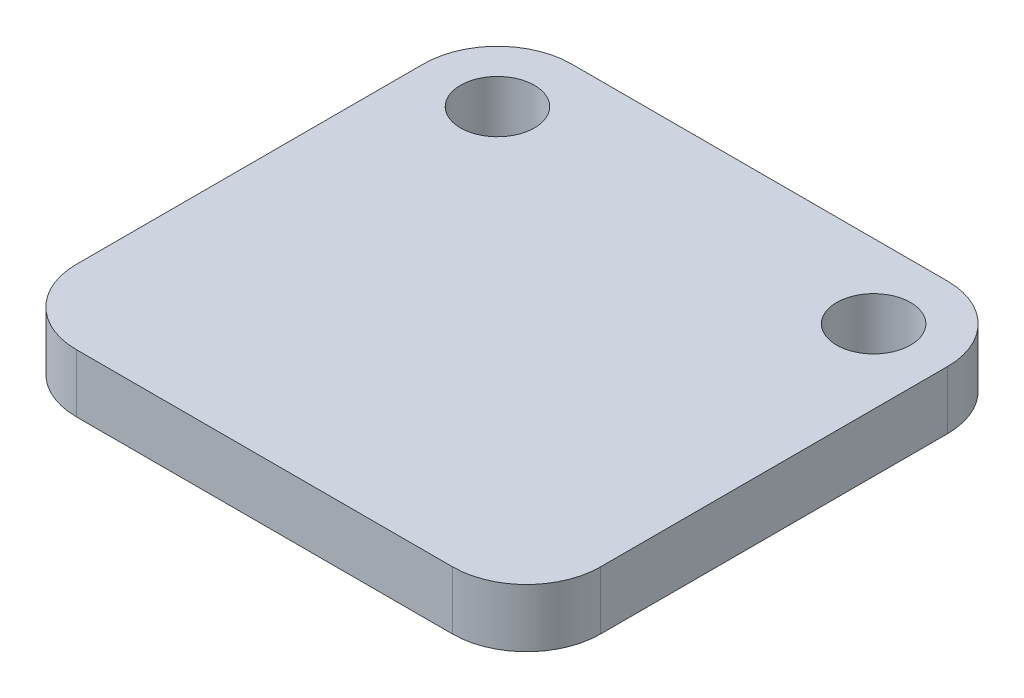
ISO-10303-21;
HEADER;
FILE_DESCRIPTION(('STEP AP214'),'2;1');
FILE_NAME('part.step','',(''),(''),'','','');
FILE_SCHEMA(('AUTOMOTIVE_DESIGN { 1 0 10303 214 1 1 1 1 }'));
ENDSEC;
DATA;
#1=APPLICATION_CONTEXT('core data for automotive mechanical design processes');
#2=APPLICATION_PROTOCOL_DEFINITION('international standard','automotive_design',2000,#1);
#3=PRODUCT_CONTEXT('',#1,'mechanical');
#4=PRODUCT('Part','Part','',(#3));
#5=PRODUCT_RELATED_PRODUCT_CATEGORY('part','',(#4));
#6=PRODUCT_DEFINITION_FORMATION('','',#4);
#7=PRODUCT_DEFINITION_CONTEXT('part definition',#1,'design');
#8=PRODUCT_DEFINITION('design','',#6,#7);
#9=PRODUCT_DEFINITION_SHAPE('','',#8);
#10=(LENGTH_UNIT() NAMED_UNIT(*) SI_UNIT(.MILLI.,.METRE.));
#11=(NAMED_UNIT(*) PLANE_ANGLE_UNIT() SI_UNIT($,.RADIAN.));
#12=(NAMED_UNIT(*) SI_UNIT($,.STERADIAN.) SOLID_ANGLE_UNIT());
#13=UNCERTAINTY_MEASURE_WITH_UNIT(LENGTH_MEASURE(1.E-05),#10,'distance_accuracy_value','');
#14=(GEOMETRIC_REPRESENTATION_CONTEXT(3) GLOBAL_UNCERTAINTY_ASSIGNED_CONTEXT((#13)) GLOBAL_UNIT_ASSIGNED_CONTEXT((#10,
#11,#12)) REPRESENTATION_CONTEXT('',''));
#15=CARTESIAN_POINT('',(0.,0.,0.));
#16=DIRECTION('',(0.,0.,1.));
#17=DIRECTION('',(1.,0.,0.));
#18=AXIS2_PLACEMENT_3D('',#15,#16,#17);
#19=CARTESIAN_POINT('',(0.,2.,0.));
#20=DIRECTION('',(1.,0.,0.));
#21=DIRECTION('',(0.,0.,-1.));
#22=AXIS2_PLACEMENT_3D('',#19,#20,#21);
#23=PLANE('',#22);
#24=DIRECTION('',(0.,0.,1.));
#25=VECTOR('',#24,1.);
#26=CARTESIAN_POINT('',(0.,0.,0.));
#27=LINE('',#26,#25);
#28=CARTESIAN_POINT('',(0.,0.,-14.46));
#29=VERTEX_POINT('',#28);
#30=CARTESIAN_POINT('',(0.,0.,-2.54));
#31=VERTEX_POINT('',#30);
#32=EDGE_CURVE('E142',#29,#31,#27,.T.);
#33=ORIENTED_EDGE('',*,*,#32,.T.);
#34=DIRECTION('',(0.,-1.,0.));
#35=VECTOR('',#34,1.);
#36=CARTESIAN_POINT('',(0.,2.,-2.54));
#37=LINE('',#36,#35);
#38=CARTESIAN_POINT('',(0.,2.,-2.54));
#39=VERTEX_POINT('',#38);
#40=EDGE_CURVE('E175',#31,#39,#37,.F.);
#41=ORIENTED_EDGE('',*,*,#40,.T.);
#42=DIRECTION('',(0.,0.,1.));
#43=VECTOR('',#42,1.);
#44=CARTESIAN_POINT('',(0.,2.,0.));
#45=LINE('',#44,#43);
#46=CARTESIAN_POINT('',(0.,2.,-14.46));
#47=VERTEX_POINT('',#46);
#48=EDGE_CURVE('E140',#47,#39,#45,.T.);
#49=ORIENTED_EDGE('',*,*,#48,.F.);
#50=DIRECTION('',(0.,-1.,0.));
#51=VECTOR('',#50,1.);
#52=CARTESIAN_POINT('',(0.,2.,-14.46));
#53=LINE('',#52,#51);
#54=EDGE_CURVE('E171',#47,#29,#53,.T.);
#55=ORIENTED_EDGE('',*,*,#54,.T.);
#56=EDGE_LOOP('',(#33,#41,#49,#55));
#57=FACE_BOUND('',#56,.T.);
#58=ADVANCED_FACE('F39',(#57),#23,.F.);
#59=CARTESIAN_POINT('',(0.,2.,0.));
#60=DIRECTION('',(0.,0.,-1.));
#61=DIRECTION('',(-1.,0.,0.));
#62=AXIS2_PLACEMENT_3D('',#59,#60,#61);
#63=PLANE('',#62);
#64=DIRECTION('',(1.,0.,0.));
#65=VECTOR('',#64,1.);
#66=CARTESIAN_POINT('',(0.,0.,0.));
#67=LINE('',#66,#65);
#68=CARTESIAN_POINT('',(2.54,0.,0.));
#69=VERTEX_POINT('',#68);
#70=CARTESIAN_POINT('',(15.46,0.,0.));
#71=VERTEX_POINT('',#70);
#72=EDGE_CURVE('E136',#69,#71,#67,.T.);
#73=ORIENTED_EDGE('',*,*,#72,.T.);
#74=DIRECTION('',(0.,-1.,0.));
#75=VECTOR('',#74,1.);
#76=CARTESIAN_POINT('',(15.46,2.,0.));
#77=LINE('',#76,#75);
#78=CARTESIAN_POINT('',(15.46,2.,0.));
#79=VERTEX_POINT('',#78);
#80=EDGE_CURVE('E111',#71,#79,#77,.F.);
#81=ORIENTED_EDGE('',*,*,#80,.T.);
#82=DIRECTION('',(1.,0.,0.));
#83=VECTOR('',#82,1.);
#84=CARTESIAN_POINT('',(0.,2.,0.));
#85=LINE('',#84,#83);
#86=CARTESIAN_POINT('',(2.54,2.,0.));
#87=VERTEX_POINT('',#86);
#88=EDGE_CURVE('E182',#87,#79,#85,.T.);
#89=ORIENTED_EDGE('',*,*,#88,.F.);
#90=DIRECTION('',(0.,-1.,0.));
#91=VECTOR('',#90,1.);
#92=CARTESIAN_POINT('',(2.54,2.,0.));
#93=LINE('',#92,#91);
#94=EDGE_CURVE('E117',#87,#69,#93,.T.);
#95=ORIENTED_EDGE('',*,*,#94,.T.);
#96=EDGE_LOOP('',(#73,#81,#89,#95));
#97=FACE_BOUND('',#96,.T.);
#98=ADVANCED_FACE('F228',(#97),#63,.F.);
#99=CARTESIAN_POINT('',(18.,2.,0.));
#100=DIRECTION('',(-1.,0.,0.));
#101=DIRECTION('',(0.,0.,1.));
#102=AXIS2_PLACEMENT_3D('',#99,#100,#101);
#103=PLANE('',#102);
#104=DIRECTION('',(0.,0.,-1.));
#105=VECTOR('',#104,1.);
#106=CARTESIAN_POINT('',(18.,2.,0.));
#107=LINE('',#106,#105);
#108=CARTESIAN_POINT('',(18.,2.,-2.54));
#109=VERTEX_POINT('',#108);
#110=CARTESIAN_POINT('',(18.,2.,-14.46));
#111=VERTEX_POINT('',#110);
#112=EDGE_CURVE('E126',#109,#111,#107,.T.);
#113=ORIENTED_EDGE('',*,*,#112,.F.);
#114=DIRECTION('',(0.,-1.,0.));
#115=VECTOR('',#114,1.);
#116=CARTESIAN_POINT('',(18.,2.,-2.54));
#117=LINE('',#116,#115);
#118=CARTESIAN_POINT('',(18.,0.,-2.54));
#119=VERTEX_POINT('',#118);
#120=EDGE_CURVE('E110',#109,#119,#117,.T.);
#121=ORIENTED_EDGE('',*,*,#120,.T.);
#122=DIRECTION('',(0.,0.,-1.));
#123=VECTOR('',#122,1.);
#124=CARTESIAN_POINT('',(18.,0.,0.));
#125=LINE('',#124,#123);
#126=CARTESIAN_POINT('',(18.,0.,-14.46));
#127=VERTEX_POINT('',#126);
#128=EDGE_CURVE('E124',#119,#127,#125,.T.);
#129=ORIENTED_EDGE('',*,*,#128,.T.);
#130=DIRECTION('',(0.,-1.,0.));
#131=VECTOR('',#130,1.);
#132=CARTESIAN_POINT('',(18.,2.,-14.46));
#133=LINE('',#132,#131);
#134=EDGE_CURVE('E129',#127,#111,#133,.F.);
#135=ORIENTED_EDGE('',*,*,#134,.T.);
#136=EDGE_LOOP('',(#113,#121,#129,#135));
#137=FACE_BOUND('',#136,.T.);
#138=ADVANCED_FACE('F123',(#137),#103,.F.);
#139=CARTESIAN_POINT('',(0.,2.,-17.));
#140=DIRECTION('',(0.,0.,1.));
#141=DIRECTION('',(1.,0.,0.));
#142=AXIS2_PLACEMENT_3D('',#139,#140,#141);
#143=PLANE('',#142);
#144=DIRECTION('',(-1.,0.,0.));
#145=VECTOR('',#144,1.);
#146=CARTESIAN_POINT('',(0.,2.,-17.));
#147=LINE('',#146,#145);
#148=CARTESIAN_POINT('',(15.46,2.,-17.));
#149=VERTEX_POINT('',#148);
#150=CARTESIAN_POINT('',(2.54,2.,-17.));
#151=VERTEX_POINT('',#150);
#152=EDGE_CURVE('E147',#149,#151,#147,.T.);
#153=ORIENTED_EDGE('',*,*,#152,.F.);
#154=DIRECTION('',(0.,-1.,0.));
#155=VECTOR('',#154,1.);
#156=CARTESIAN_POINT('',(15.46,2.,-17.));
#157=LINE('',#156,#155);
#158=CARTESIAN_POINT('',(15.46,0.,-17.));
#159=VERTEX_POINT('',#158);
#160=EDGE_CURVE('E11',#149,#159,#157,.T.);
#161=ORIENTED_EDGE('',*,*,#160,.T.);
#162=DIRECTION('',(-1.,0.,0.));
#163=VECTOR('',#162,1.);
#164=CARTESIAN_POINT('',(0.,0.,-17.));
#165=LINE('',#164,#163);
#166=CARTESIAN_POINT('',(2.54,0.,-17.));
#167=VERTEX_POINT('',#166);
#168=EDGE_CURVE('E135',#159,#167,#165,.T.);
#169=ORIENTED_EDGE('',*,*,#168,.T.);
#170=DIRECTION('',(0.,-1.,0.));
#171=VECTOR('',#170,1.);
#172=CARTESIAN_POINT('',(2.54,2.,-17.));
#173=LINE('',#172,#171);
#174=EDGE_CURVE('E48',#167,#151,#173,.F.);
#175=ORIENTED_EDGE('',*,*,#174,.T.);
#176=EDGE_LOOP('',(#153,#161,#169,#175));
#177=FACE_BOUND('',#176,.T.);
#178=ADVANCED_FACE('F222',(#177),#143,.F.);
#179=CARTESIAN_POINT('',(0.,2.,0.));
#180=DIRECTION('',(0.,-1.,0.));
#181=DIRECTION('',(0.,0.,-1.));
#182=AXIS2_PLACEMENT_3D('',#179,#180,#181);
#183=PLANE('',#182);
#184=CARTESIAN_POINT('',(2.54,2.,-14.46));
#185=DIRECTION('',(0.,1.,0.));
#186=DIRECTION('',(0.,0.,1.));
#187=AXIS2_PLACEMENT_3D('',#184,#185,#186);
#188=CIRCLE('',#187,1.27);
#189=CARTESIAN_POINT('',(2.54,2.,-13.19));
#190=VERTEX_POINT('',#189);
#191=EDGE_CURVE('E202',#190,#190,#188,.T.);
#192=ORIENTED_EDGE('',*,*,#191,.F.);
#193=EDGE_LOOP('',(#192));
#194=FACE_BOUND('',#193,.T.);
#195=CARTESIAN_POINT('',(15.46,2.,-14.46));
#196=DIRECTION('',(0.,1.,0.));
#197=DIRECTION('',(0.,0.,-1.));
#198=AXIS2_PLACEMENT_3D('',#195,#196,#197);
#199=CIRCLE('',#198,1.27);
#200=CARTESIAN_POINT('',(15.46,2.,-15.73));
#201=VERTEX_POINT('',#200);
#202=EDGE_CURVE('E192',#201,#201,#199,.T.);
#203=ORIENTED_EDGE('',*,*,#202,.F.);
#204=EDGE_LOOP('',(#203));
#205=FACE_BOUND('',#204,.T.);
#206=ORIENTED_EDGE('',*,*,#88,.T.);
#207=CARTESIAN_POINT('',(15.46,2.,-2.54));
#208=DIRECTION('',(0.,-1.,0.));
#209=DIRECTION('',(0.,0.,-1.));
#210=AXIS2_PLACEMENT_3D('',#207,#208,#209);
#211=CIRCLE('',#210,2.54);
#212=EDGE_CURVE('E168',#79,#109,#211,.F.);
#213=ORIENTED_EDGE('',*,*,#212,.T.);
#214=ORIENTED_EDGE('',*,*,#112,.T.);
#215=CARTESIAN_POINT('',(15.46,2.,-14.46));
#216=DIRECTION('',(0.,-1.,0.));
#217=DIRECTION('',(0.,0.,-1.));
#218=AXIS2_PLACEMENT_3D('',#215,#216,#217);
#219=CIRCLE('',#218,2.54);
#220=EDGE_CURVE('E61',#111,#149,#219,.F.);
#221=ORIENTED_EDGE('',*,*,#220,.T.);
#222=ORIENTED_EDGE('',*,*,#152,.T.);
#223=CARTESIAN_POINT('',(2.54,2.,-14.46));
#224=DIRECTION('',(0.,-1.,0.));
#225=DIRECTION('',(0.,0.,-1.));
#226=AXIS2_PLACEMENT_3D('',#223,#224,#225);
#227=CIRCLE('',#226,2.54);
#228=EDGE_CURVE('E160',#151,#47,#227,.F.);
#229=ORIENTED_EDGE('',*,*,#228,.T.);
#230=ORIENTED_EDGE('',*,*,#48,.T.);
#231=CARTESIAN_POINT('',(2.54,2.,-2.54));
#232=DIRECTION('',(0.,-1.,0.));
#233=DIRECTION('',(0.,0.,-1.));
#234=AXIS2_PLACEMENT_3D('',#231,#232,#233);
#235=CIRCLE('',#234,2.54);
#236=EDGE_CURVE('E165',#39,#87,#235,.F.);
#237=ORIENTED_EDGE('',*,*,#236,.T.);
#238=EDGE_LOOP('',(#206,#213,#214,#221,#222,#229,#230,#237));
#239=FACE_BOUND('',#238,.T.);
#240=ADVANCED_FACE('F220',(#194,#205,#239),#183,.F.);
#241=CARTESIAN_POINT('',(0.,0.,0.));
#242=DIRECTION('',(0.,-1.,0.));
#243=DIRECTION('',(0.,0.,-1.));
#244=AXIS2_PLACEMENT_3D('',#241,#242,#243);
#245=PLANE('',#244);
#246=CARTESIAN_POINT('',(2.54,0.,-14.46));
#247=DIRECTION('',(0.,1.,0.));
#248=DIRECTION('',(0.,0.,1.));
#249=AXIS2_PLACEMENT_3D('',#246,#247,#248);
#250=CIRCLE('',#249,1.27);
#251=CARTESIAN_POINT('',(2.54,0.,-13.19));
#252=VERTEX_POINT('',#251);
#253=EDGE_CURVE('E196',#252,#252,#250,.T.);
#254=ORIENTED_EDGE('',*,*,#253,.T.);
#255=EDGE_LOOP('',(#254));
#256=FACE_BOUND('',#255,.T.);
#257=CARTESIAN_POINT('',(15.46,0.,-14.46));
#258=DIRECTION('',(0.,1.,0.));
#259=DIRECTION('',(0.,0.,-1.));
#260=AXIS2_PLACEMENT_3D('',#257,#258,#259);
#261=CIRCLE('',#260,1.27);
#262=CARTESIAN_POINT('',(15.46,0.,-15.73));
#263=VERTEX_POINT('',#262);
#264=EDGE_CURVE('E208',#263,#263,#261,.T.);
#265=ORIENTED_EDGE('',*,*,#264,.T.);
#266=EDGE_LOOP('',(#265));
#267=FACE_BOUND('',#266,.T.);
#268=ORIENTED_EDGE('',*,*,#128,.F.);
#269=CARTESIAN_POINT('',(15.46,0.,-2.54));
#270=DIRECTION('',(0.,-1.,0.));
#271=DIRECTION('',(0.,0.,-1.));
#272=AXIS2_PLACEMENT_3D('',#269,#270,#271);
#273=CIRCLE('',#272,2.54);
#274=EDGE_CURVE('E106',#119,#71,#273,.T.);
#275=ORIENTED_EDGE('',*,*,#274,.T.);
#276=ORIENTED_EDGE('',*,*,#72,.F.);
#277=CARTESIAN_POINT('',(2.54,0.,-2.54));
#278=DIRECTION('',(0.,-1.,0.));
#279=DIRECTION('',(0.,0.,-1.));
#280=AXIS2_PLACEMENT_3D('',#277,#278,#279);
#281=CIRCLE('',#280,2.54);
#282=EDGE_CURVE('E118',#69,#31,#281,.T.);
#283=ORIENTED_EDGE('',*,*,#282,.T.);
#284=ORIENTED_EDGE('',*,*,#32,.F.);
#285=CARTESIAN_POINT('',(2.54,0.,-14.46));
#286=DIRECTION('',(0.,-1.,0.));
#287=DIRECTION('',(0.,0.,-1.));
#288=AXIS2_PLACEMENT_3D('',#285,#286,#287);
#289=CIRCLE('',#288,2.54);
#290=EDGE_CURVE('E128',#29,#167,#289,.T.);
#291=ORIENTED_EDGE('',*,*,#290,.T.);
#292=ORIENTED_EDGE('',*,*,#168,.F.);
#293=CARTESIAN_POINT('',(15.46,0.,-14.46));
#294=DIRECTION('',(0.,-1.,0.));
#295=DIRECTION('',(0.,0.,-1.));
#296=AXIS2_PLACEMENT_3D('',#293,#294,#295);
#297=CIRCLE('',#296,2.54);
#298=EDGE_CURVE('E133',#159,#127,#297,.T.);
#299=ORIENTED_EDGE('',*,*,#298,.T.);
#300=EDGE_LOOP('',(#268,#275,#276,#283,#284,#291,#292,#299));
#301=FACE_BOUND('',#300,.T.);
#302=ADVANCED_FACE('F131',(#256,#267,#301),#245,.T.);
#303=CARTESIAN_POINT('',(15.46,0.,-14.46));
#304=DIRECTION('',(0.,1.,0.));
#305=DIRECTION('',(0.,0.,1.));
#306=AXIS2_PLACEMENT_3D('',#303,#304,#305);
#307=CYLINDRICAL_SURFACE('',#306,1.27);
#308=ORIENTED_EDGE('',*,*,#264,.F.);
#309=EDGE_LOOP('',(#308));
#310=FACE_BOUND('',#309,.T.);
#311=ORIENTED_EDGE('',*,*,#202,.T.);
#312=EDGE_LOOP('',(#311));
#313=FACE_BOUND('',#312,.T.);
#314=ADVANCED_FACE('F218',(#310,#313),#307,.F.);
#315=CARTESIAN_POINT('',(2.54,0.,-14.46));
#316=DIRECTION('',(0.,1.,0.));
#317=DIRECTION('',(0.,0.,1.));
#318=AXIS2_PLACEMENT_3D('',#315,#316,#317);
#319=CYLINDRICAL_SURFACE('',#318,1.27);
#320=ORIENTED_EDGE('',*,*,#253,.F.);
#321=EDGE_LOOP('',(#320));
#322=FACE_BOUND('',#321,.T.);
#323=ORIENTED_EDGE('',*,*,#191,.T.);
#324=EDGE_LOOP('',(#323));
#325=FACE_BOUND('',#324,.T.);
#326=ADVANCED_FACE('F245',(#322,#325),#319,.F.);
#327=CARTESIAN_POINT('',(15.46,2.,-2.54));
#328=DIRECTION('',(0.,-1.,0.));
#329=DIRECTION('',(0.,0.,-1.));
#330=AXIS2_PLACEMENT_3D('',#327,#328,#329);
#331=CYLINDRICAL_SURFACE('',#330,2.54);
#332=ORIENTED_EDGE('',*,*,#212,.F.);
#333=ORIENTED_EDGE('',*,*,#80,.F.);
#334=ORIENTED_EDGE('',*,*,#274,.F.);
#335=ORIENTED_EDGE('',*,*,#120,.F.);
#336=EDGE_LOOP('',(#332,#333,#334,#335));
#337=FACE_BOUND('',#336,.T.);
#338=ADVANCED_FACE('F109',(#337),#331,.T.);
#339=CARTESIAN_POINT('',(2.54,2.,-2.54));
#340=DIRECTION('',(0.,-1.,0.));
#341=DIRECTION('',(0.,0.,-1.));
#342=AXIS2_PLACEMENT_3D('',#339,#340,#341);
#343=CYLINDRICAL_SURFACE('',#342,2.54);
#344=ORIENTED_EDGE('',*,*,#236,.F.);
#345=ORIENTED_EDGE('',*,*,#40,.F.);
#346=ORIENTED_EDGE('',*,*,#282,.F.);
#347=ORIENTED_EDGE('',*,*,#94,.F.);
#348=EDGE_LOOP('',(#344,#345,#346,#347));
#349=FACE_BOUND('',#348,.T.);
#350=ADVANCED_FACE('F230',(#349),#343,.T.);
#351=CARTESIAN_POINT('',(15.46,2.,-14.46));
#352=DIRECTION('',(0.,-1.,0.));
#353=DIRECTION('',(0.,0.,-1.));
#354=AXIS2_PLACEMENT_3D('',#351,#352,#353);
#355=CYLINDRICAL_SURFACE('',#354,2.54);
#356=ORIENTED_EDGE('',*,*,#220,.F.);
#357=ORIENTED_EDGE('',*,*,#134,.F.);
#358=ORIENTED_EDGE('',*,*,#298,.F.);
#359=ORIENTED_EDGE('',*,*,#160,.F.);
#360=EDGE_LOOP('',(#356,#357,#358,#359));
#361=FACE_BOUND('',#360,.T.);
#362=ADVANCED_FACE('F247',(#361),#355,.T.);
#363=CARTESIAN_POINT('',(2.54,2.,-14.46));
#364=DIRECTION('',(0.,-1.,0.));
#365=DIRECTION('',(0.,0.,-1.));
#366=AXIS2_PLACEMENT_3D('',#363,#364,#365);
#367=CYLINDRICAL_SURFACE('',#366,2.54);
#368=ORIENTED_EDGE('',*,*,#228,.F.);
#369=ORIENTED_EDGE('',*,*,#174,.F.);
#370=ORIENTED_EDGE('',*,*,#290,.F.);
#371=ORIENTED_EDGE('',*,*,#54,.F.);
#372=EDGE_LOOP('',(#368,#369,#370,#371));
#373=FACE_BOUND('',#372,.T.);
#374=ADVANCED_FACE('F41',(#373),#367,.T.);
#375=CLOSED_SHELL('',(#58,#98,#138,#178,#240,#302,#314,#326,#338,#350,#362,#374));
#376=MANIFOLD_SOLID_BREP('B2',#375);
#377=ADVANCED_BREP_SHAPE_REPRESENTATION('',(#18,#376),#14);
#378=SHAPE_DEFINITION_REPRESENTATION(#9,#377);
ENDSEC;
END-ISO-10303-21;
